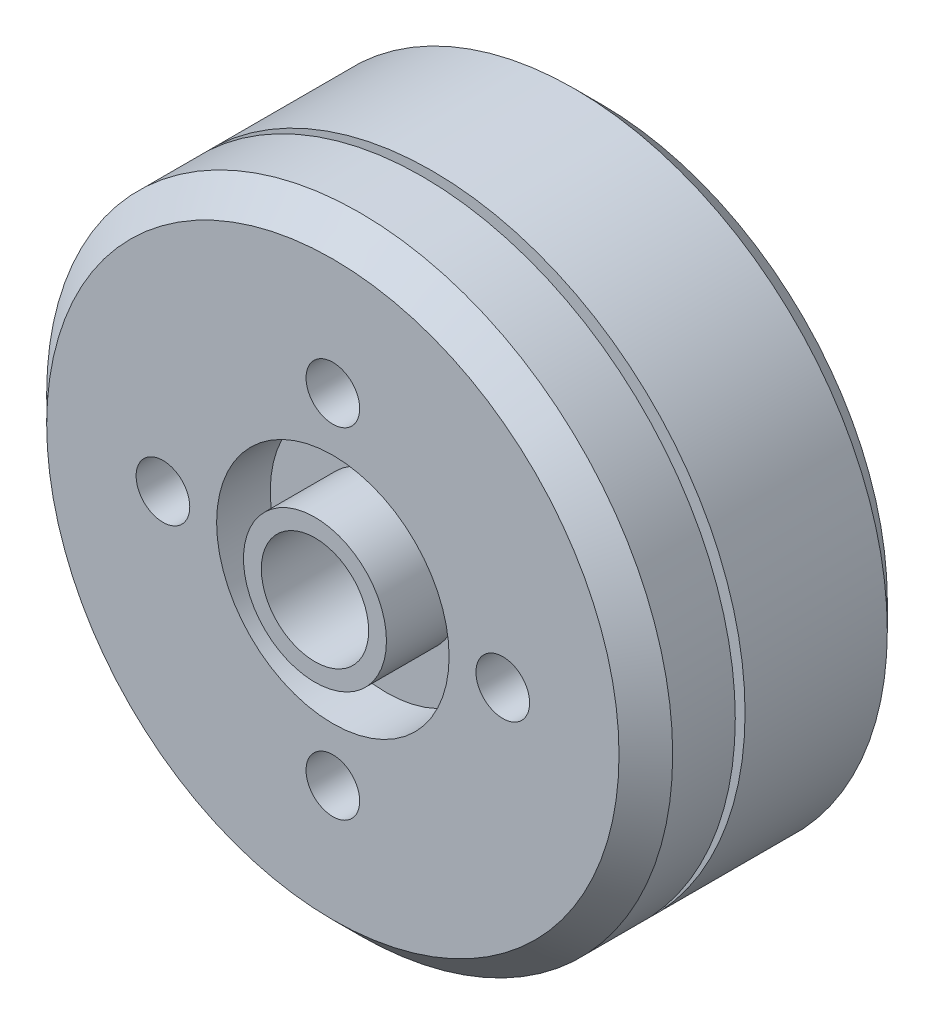
ISO-10303-21;
HEADER;
FILE_DESCRIPTION(('STEP AP214'),'2;1');
FILE_NAME('part.step','',(''),(''),'','','');
FILE_SCHEMA(('AUTOMOTIVE_DESIGN { 1 0 10303 214 1 1 1 1 }'));
ENDSEC;
DATA;
#1=APPLICATION_CONTEXT('core data for automotive mechanical design processes');
#2=APPLICATION_PROTOCOL_DEFINITION('international standard','automotive_design',2000,#1);
#3=PRODUCT_CONTEXT('',#1,'mechanical');
#4=PRODUCT('Part','Part','',(#3));
#5=PRODUCT_RELATED_PRODUCT_CATEGORY('part','',(#4));
#6=PRODUCT_DEFINITION_FORMATION('','',#4);
#7=PRODUCT_DEFINITION_CONTEXT('part definition',#1,'design');
#8=PRODUCT_DEFINITION('design','',#6,#7);
#9=PRODUCT_DEFINITION_SHAPE('','',#8);
#10=(LENGTH_UNIT() NAMED_UNIT(*) SI_UNIT(.MILLI.,.METRE.));
#11=(NAMED_UNIT(*) PLANE_ANGLE_UNIT() SI_UNIT($,.RADIAN.));
#12=(NAMED_UNIT(*) SI_UNIT($,.STERADIAN.) SOLID_ANGLE_UNIT());
#13=UNCERTAINTY_MEASURE_WITH_UNIT(LENGTH_MEASURE(1.E-05),#10,'distance_accuracy_value','');
#14=(GEOMETRIC_REPRESENTATION_CONTEXT(3) GLOBAL_UNCERTAINTY_ASSIGNED_CONTEXT((#13)) GLOBAL_UNIT_ASSIGNED_CONTEXT((#10,
#11,#12)) REPRESENTATION_CONTEXT('',''));
#15=CARTESIAN_POINT('',(0.,0.,0.));
#16=DIRECTION('',(0.,0.,1.));
#17=DIRECTION('',(1.,0.,0.));
#18=AXIS2_PLACEMENT_3D('',#15,#16,#17);
#19=CARTESIAN_POINT('',(0.,0.,15.));
#20=DIRECTION('',(0.,0.,-1.));
#21=DIRECTION('',(-1.,0.,0.));
#22=AXIS2_PLACEMENT_3D('',#19,#20,#21);
#23=CYLINDRICAL_SURFACE('',#22,17.5);
#24=CARTESIAN_POINT('',(0.,0.,1.5));
#25=DIRECTION('',(0.,0.,1.));
#26=DIRECTION('',(1.,0.,0.));
#27=AXIS2_PLACEMENT_3D('',#24,#25,#26);
#28=CIRCLE('',#27,17.5);
#29=CARTESIAN_POINT('',(17.5,0.,1.5));
#30=VERTEX_POINT('',#29);
#31=EDGE_CURVE('E45',#30,#30,#28,.T.);
#32=ORIENTED_EDGE('',*,*,#31,.T.);
#33=EDGE_LOOP('',(#32));
#34=FACE_BOUND('',#33,.T.);
#35=CARTESIAN_POINT('',(0.,0.,9.45314457112844));
#36=DIRECTION('',(0.,0.,-1.));
#37=DIRECTION('',(-1.,0.,0.));
#38=AXIS2_PLACEMENT_3D('',#35,#36,#37);
#39=CIRCLE('',#38,17.5);
#40=CARTESIAN_POINT('',(-17.5,0.,9.45314457112844));
#41=VERTEX_POINT('',#40);
#42=EDGE_CURVE('E62',#41,#41,#39,.T.);
#43=ORIENTED_EDGE('',*,*,#42,.T.);
#44=EDGE_LOOP('',(#43));
#45=FACE_BOUND('',#44,.T.);
#46=ADVANCED_FACE('F37',(#34,#45),#23,.T.);
#47=CARTESIAN_POINT('',(0.,0.,0.));
#48=DIRECTION('',(0.,0.,1.));
#49=DIRECTION('',(1.,0.,0.));
#50=AXIS2_PLACEMENT_3D('',#47,#48,#49);
#51=PLANE('',#50);
#52=CARTESIAN_POINT('',(0.,0.,0.));
#53=DIRECTION('',(0.,0.,1.));
#54=DIRECTION('',(1.,0.,0.));
#55=AXIS2_PLACEMENT_3D('',#52,#53,#54);
#56=CIRCLE('',#55,16.);
#57=CARTESIAN_POINT('',(16.,0.,0.));
#58=VERTEX_POINT('',#57);
#59=EDGE_CURVE('E10',#58,#58,#56,.F.);
#60=ORIENTED_EDGE('',*,*,#59,.T.);
#61=EDGE_LOOP('',(#60));
#62=FACE_BOUND('',#61,.T.);
#63=CARTESIAN_POINT('',(0.,0.,0.));
#64=DIRECTION('',(0.,0.,-1.));
#65=DIRECTION('',(-1.,0.,0.));
#66=AXIS2_PLACEMENT_3D('',#63,#64,#65);
#67=CIRCLE('',#66,3.);
#68=CARTESIAN_POINT('',(-3.,0.,0.));
#69=VERTEX_POINT('',#68);
#70=EDGE_CURVE('E109',#69,#69,#67,.T.);
#71=ORIENTED_EDGE('',*,*,#70,.F.);
#72=EDGE_LOOP('',(#71));
#73=FACE_BOUND('',#72,.T.);
#74=CARTESIAN_POINT('',(0.,-8.,0.));
#75=DIRECTION('',(0.,0.,-1.));
#76=DIRECTION('',(-1.,0.,0.));
#77=AXIS2_PLACEMENT_3D('',#74,#75,#76);
#78=CIRCLE('',#77,1.5);
#79=CARTESIAN_POINT('',(-1.5,-8.,0.));
#80=VERTEX_POINT('',#79);
#81=EDGE_CURVE('E95',#80,#80,#78,.T.);
#82=ORIENTED_EDGE('',*,*,#81,.F.);
#83=EDGE_LOOP('',(#82));
#84=FACE_BOUND('',#83,.T.);
#85=CARTESIAN_POINT('',(8.,0.,0.));
#86=DIRECTION('',(0.,0.,-1.));
#87=DIRECTION('',(-1.,0.,0.));
#88=AXIS2_PLACEMENT_3D('',#85,#86,#87);
#89=CIRCLE('',#88,1.5);
#90=CARTESIAN_POINT('',(6.5,0.,0.));
#91=VERTEX_POINT('',#90);
#92=EDGE_CURVE('E87',#91,#91,#89,.T.);
#93=ORIENTED_EDGE('',*,*,#92,.F.);
#94=EDGE_LOOP('',(#93));
#95=FACE_BOUND('',#94,.T.);
#96=CARTESIAN_POINT('',(0.,8.,0.));
#97=DIRECTION('',(0.,0.,-1.));
#98=DIRECTION('',(-1.,0.,0.));
#99=AXIS2_PLACEMENT_3D('',#96,#97,#98);
#100=CIRCLE('',#99,1.5);
#101=CARTESIAN_POINT('',(-1.50000000000005,8.,0.));
#102=VERTEX_POINT('',#101);
#103=EDGE_CURVE('E79',#102,#102,#100,.T.);
#104=ORIENTED_EDGE('',*,*,#103,.F.);
#105=EDGE_LOOP('',(#104));
#106=FACE_BOUND('',#105,.T.);
#107=CARTESIAN_POINT('',(-8.,0.,0.));
#108=DIRECTION('',(0.,0.,-1.));
#109=DIRECTION('',(-1.,0.,0.));
#110=AXIS2_PLACEMENT_3D('',#107,#108,#109);
#111=CIRCLE('',#110,1.5);
#112=CARTESIAN_POINT('',(-9.5,0.,0.));
#113=VERTEX_POINT('',#112);
#114=EDGE_CURVE('E66',#113,#113,#111,.T.);
#115=ORIENTED_EDGE('',*,*,#114,.F.);
#116=EDGE_LOOP('',(#115));
#117=FACE_BOUND('',#116,.T.);
#118=ADVANCED_FACE('F180',(#62,#73,#84,#95,#106,#117),#51,.F.);
#119=CARTESIAN_POINT('',(-8.,0.,4.99999999999999));
#120=DIRECTION('',(0.,0.,-1.));
#121=DIRECTION('',(-1.,0.,0.));
#122=AXIS2_PLACEMENT_3D('',#119,#120,#121);
#123=CYLINDRICAL_SURFACE('',#122,1.5);
#124=CARTESIAN_POINT('',(-8.,0.,4.99999999999999));
#125=DIRECTION('',(0.,0.,-1.));
#126=DIRECTION('',(-1.,0.,0.));
#127=AXIS2_PLACEMENT_3D('',#124,#125,#126);
#128=CIRCLE('',#127,1.5);
#129=CARTESIAN_POINT('',(-9.5,0.,4.99999999999999));
#130=VERTEX_POINT('',#129);
#131=EDGE_CURVE('E75',#130,#130,#128,.T.);
#132=ORIENTED_EDGE('',*,*,#131,.F.);
#133=EDGE_LOOP('',(#132));
#134=FACE_BOUND('',#133,.T.);
#135=ORIENTED_EDGE('',*,*,#114,.T.);
#136=EDGE_LOOP('',(#135));
#137=FACE_BOUND('',#136,.T.);
#138=ADVANCED_FACE('F186',(#134,#137),#123,.F.);
#139=CARTESIAN_POINT('',(-8.,0.,4.99999999999999));
#140=DIRECTION('',(0.,0.,-1.));
#141=DIRECTION('',(-1.,0.,0.));
#142=AXIS2_PLACEMENT_3D('',#139,#140,#141);
#143=PLANE('',#142);
#144=ORIENTED_EDGE('',*,*,#131,.T.);
#145=EDGE_LOOP('',(#144));
#146=FACE_BOUND('',#145,.T.);
#147=ADVANCED_FACE('F244',(#146),#143,.T.);
#148=CARTESIAN_POINT('',(0.,8.,4.99999999999999));
#149=DIRECTION('',(0.,0.,-1.));
#150=DIRECTION('',(-1.,0.,0.));
#151=AXIS2_PLACEMENT_3D('',#148,#149,#150);
#152=CYLINDRICAL_SURFACE('',#151,1.5);
#153=CARTESIAN_POINT('',(0.,8.,4.99999999999999));
#154=DIRECTION('',(0.,0.,-1.));
#155=DIRECTION('',(-1.,0.,0.));
#156=AXIS2_PLACEMENT_3D('',#153,#154,#155);
#157=CIRCLE('',#156,1.5);
#158=CARTESIAN_POINT('',(-1.50000000000005,8.,4.99999999999999));
#159=VERTEX_POINT('',#158);
#160=EDGE_CURVE('E83',#159,#159,#157,.T.);
#161=ORIENTED_EDGE('',*,*,#160,.F.);
#162=EDGE_LOOP('',(#161));
#163=FACE_BOUND('',#162,.T.);
#164=ORIENTED_EDGE('',*,*,#103,.T.);
#165=EDGE_LOOP('',(#164));
#166=FACE_BOUND('',#165,.T.);
#167=ADVANCED_FACE('F240',(#163,#166),#152,.F.);
#168=CARTESIAN_POINT('',(0.,8.,4.99999999999999));
#169=DIRECTION('',(0.,0.,-1.));
#170=DIRECTION('',(-1.,0.,0.));
#171=AXIS2_PLACEMENT_3D('',#168,#169,#170);
#172=PLANE('',#171);
#173=ORIENTED_EDGE('',*,*,#160,.T.);
#174=EDGE_LOOP('',(#173));
#175=FACE_BOUND('',#174,.T.);
#176=ADVANCED_FACE('F236',(#175),#172,.T.);
#177=CARTESIAN_POINT('',(8.,0.,4.99999999999999));
#178=DIRECTION('',(0.,0.,-1.));
#179=DIRECTION('',(-1.,0.,0.));
#180=AXIS2_PLACEMENT_3D('',#177,#178,#179);
#181=CYLINDRICAL_SURFACE('',#180,1.5);
#182=CARTESIAN_POINT('',(8.,0.,4.99999999999999));
#183=DIRECTION('',(0.,0.,-1.));
#184=DIRECTION('',(-1.,0.,0.));
#185=AXIS2_PLACEMENT_3D('',#182,#183,#184);
#186=CIRCLE('',#185,1.5);
#187=CARTESIAN_POINT('',(6.5,0.,4.99999999999999));
#188=VERTEX_POINT('',#187);
#189=EDGE_CURVE('E91',#188,#188,#186,.T.);
#190=ORIENTED_EDGE('',*,*,#189,.F.);
#191=EDGE_LOOP('',(#190));
#192=FACE_BOUND('',#191,.T.);
#193=ORIENTED_EDGE('',*,*,#92,.T.);
#194=EDGE_LOOP('',(#193));
#195=FACE_BOUND('',#194,.T.);
#196=ADVANCED_FACE('F232',(#192,#195),#181,.F.);
#197=CARTESIAN_POINT('',(8.,0.,4.99999999999999));
#198=DIRECTION('',(0.,0.,-1.));
#199=DIRECTION('',(-1.,0.,0.));
#200=AXIS2_PLACEMENT_3D('',#197,#198,#199);
#201=PLANE('',#200);
#202=ORIENTED_EDGE('',*,*,#189,.T.);
#203=EDGE_LOOP('',(#202));
#204=FACE_BOUND('',#203,.T.);
#205=ADVANCED_FACE('F228',(#204),#201,.T.);
#206=CARTESIAN_POINT('',(0.,-8.,4.99999999999999));
#207=DIRECTION('',(0.,0.,-1.));
#208=DIRECTION('',(-1.,0.,0.));
#209=AXIS2_PLACEMENT_3D('',#206,#207,#208);
#210=CYLINDRICAL_SURFACE('',#209,1.5);
#211=CARTESIAN_POINT('',(0.,-8.,4.99999999999999));
#212=DIRECTION('',(0.,0.,-1.));
#213=DIRECTION('',(-1.,0.,0.));
#214=AXIS2_PLACEMENT_3D('',#211,#212,#213);
#215=CIRCLE('',#214,1.5);
#216=CARTESIAN_POINT('',(-1.5,-8.,4.99999999999999));
#217=VERTEX_POINT('',#216);
#218=EDGE_CURVE('E61',#217,#217,#215,.T.);
#219=ORIENTED_EDGE('',*,*,#218,.F.);
#220=EDGE_LOOP('',(#219));
#221=FACE_BOUND('',#220,.T.);
#222=ORIENTED_EDGE('',*,*,#81,.T.);
#223=EDGE_LOOP('',(#222));
#224=FACE_BOUND('',#223,.T.);
#225=ADVANCED_FACE('F224',(#221,#224),#210,.F.);
#226=CARTESIAN_POINT('',(0.,-8.,4.99999999999999));
#227=DIRECTION('',(0.,0.,-1.));
#228=DIRECTION('',(-1.,0.,0.));
#229=AXIS2_PLACEMENT_3D('',#226,#227,#228);
#230=PLANE('',#229);
#231=ORIENTED_EDGE('',*,*,#218,.T.);
#232=EDGE_LOOP('',(#231));
#233=FACE_BOUND('',#232,.T.);
#234=ADVANCED_FACE('F217',(#233),#230,.T.);
#235=CARTESIAN_POINT('',(13.2844337972272,0.,9.45314457112844));
#236=DIRECTION('',(0.,0.,-1.));
#237=DIRECTION('',(-1.,0.,0.));
#238=AXIS2_PLACEMENT_3D('',#235,#236,#237);
#239=PLANE('',#238);
#240=CARTESIAN_POINT('',(0.,0.,9.45314457112844));
#241=DIRECTION('',(0.,0.,-1.));
#242=DIRECTION('',(-1.,0.,0.));
#243=AXIS2_PLACEMENT_3D('',#240,#241,#242);
#244=CIRCLE('',#243,13.2844337972272);
#245=CARTESIAN_POINT('',(-13.2844337972272,0.,9.45314457112844));
#246=VERTEX_POINT('',#245);
#247=EDGE_CURVE('E71',#246,#246,#244,.T.);
#248=ORIENTED_EDGE('',*,*,#247,.T.);
#249=EDGE_LOOP('',(#248));
#250=FACE_BOUND('',#249,.T.);
#251=ORIENTED_EDGE('',*,*,#42,.F.);
#252=EDGE_LOOP('',(#251));
#253=FACE_BOUND('',#252,.T.);
#254=ADVANCED_FACE('F208',(#250,#253),#239,.F.);
#255=CARTESIAN_POINT('',(17.969347124329,0.,10.));
#256=DIRECTION('',(0.,0.,1.));
#257=DIRECTION('',(1.,0.,0.));
#258=AXIS2_PLACEMENT_3D('',#255,#256,#257);
#259=PLANE('',#258);
#260=CARTESIAN_POINT('',(0.,0.,10.));
#261=DIRECTION('',(0.,0.,-1.));
#262=DIRECTION('',(-1.,0.,0.));
#263=AXIS2_PLACEMENT_3D('',#260,#261,#262);
#264=CIRCLE('',#263,13.2844337972272);
#265=CARTESIAN_POINT('',(-13.2844337972272,0.,10.));
#266=VERTEX_POINT('',#265);
#267=EDGE_CURVE('E105',#266,#266,#264,.T.);
#268=ORIENTED_EDGE('',*,*,#267,.F.);
#269=EDGE_LOOP('',(#268));
#270=FACE_BOUND('',#269,.T.);
#271=CARTESIAN_POINT('',(0.,0.,10.));
#272=DIRECTION('',(0.,0.,1.));
#273=DIRECTION('',(1.,0.,0.));
#274=AXIS2_PLACEMENT_3D('',#271,#272,#273);
#275=CIRCLE('',#274,17.5);
#276=CARTESIAN_POINT('',(17.5,0.,10.));
#277=VERTEX_POINT('',#276);
#278=EDGE_CURVE('E67',#277,#277,#275,.T.);
#279=ORIENTED_EDGE('',*,*,#278,.F.);
#280=EDGE_LOOP('',(#279));
#281=FACE_BOUND('',#280,.T.);
#282=ADVANCED_FACE('F206',(#270,#281),#259,.F.);
#283=CARTESIAN_POINT('',(0.,0.,0.));
#284=DIRECTION('',(0.,0.,-1.));
#285=DIRECTION('',(-1.,0.,0.));
#286=AXIS2_PLACEMENT_3D('',#283,#284,#285);
#287=CYLINDRICAL_SURFACE('',#286,13.2844337972272);
#288=ORIENTED_EDGE('',*,*,#247,.F.);
#289=EDGE_LOOP('',(#288));
#290=FACE_BOUND('',#289,.T.);
#291=ORIENTED_EDGE('',*,*,#267,.T.);
#292=EDGE_LOOP('',(#291));
#293=FACE_BOUND('',#292,.T.);
#294=ADVANCED_FACE('F199',(#290,#293),#287,.T.);
#295=CARTESIAN_POINT('',(0.,0.,15.));
#296=DIRECTION('',(0.,0.,1.));
#297=DIRECTION('',(1.,0.,0.));
#298=AXIS2_PLACEMENT_3D('',#295,#296,#297);
#299=PLANE('',#298);
#300=CARTESIAN_POINT('',(0.,0.,15.));
#301=DIRECTION('',(0.,0.,1.));
#302=DIRECTION('',(1.,0.,0.));
#303=AXIS2_PLACEMENT_3D('',#300,#301,#302);
#304=CIRCLE('',#303,6.5);
#305=CARTESIAN_POINT('',(6.5,0.,15.));
#306=VERTEX_POINT('',#305);
#307=EDGE_CURVE('E146',#306,#306,#304,.T.);
#308=ORIENTED_EDGE('',*,*,#307,.F.);
#309=EDGE_LOOP('',(#308));
#310=FACE_BOUND('',#309,.T.);
#311=CARTESIAN_POINT('',(0.,0.,15.));
#312=DIRECTION('',(0.,0.,1.));
#313=DIRECTION('',(1.,0.,0.));
#314=AXIS2_PLACEMENT_3D('',#311,#312,#313);
#315=CIRCLE('',#314,16.);
#316=CARTESIAN_POINT('',(16.,0.,15.));
#317=VERTEX_POINT('',#316);
#318=EDGE_CURVE('E55',#317,#317,#315,.T.);
#319=ORIENTED_EDGE('',*,*,#318,.T.);
#320=EDGE_LOOP('',(#319));
#321=FACE_BOUND('',#320,.T.);
#322=CARTESIAN_POINT('',(0.,-9.5,15.));
#323=DIRECTION('',(0.,0.,1.));
#324=DIRECTION('',(1.,0.,0.));
#325=AXIS2_PLACEMENT_3D('',#322,#323,#324);
#326=CIRCLE('',#325,1.5);
#327=CARTESIAN_POINT('',(1.5,-9.5,15.));
#328=VERTEX_POINT('',#327);
#329=EDGE_CURVE('E139',#328,#328,#326,.T.);
#330=ORIENTED_EDGE('',*,*,#329,.F.);
#331=EDGE_LOOP('',(#330));
#332=FACE_BOUND('',#331,.T.);
#333=CARTESIAN_POINT('',(-9.5,0.,15.));
#334=DIRECTION('',(0.,0.,1.));
#335=DIRECTION('',(1.,0.,0.));
#336=AXIS2_PLACEMENT_3D('',#333,#334,#335);
#337=CIRCLE('',#336,1.5);
#338=CARTESIAN_POINT('',(-8.,0.,15.));
#339=VERTEX_POINT('',#338);
#340=EDGE_CURVE('E131',#339,#339,#337,.T.);
#341=ORIENTED_EDGE('',*,*,#340,.F.);
#342=EDGE_LOOP('',(#341));
#343=FACE_BOUND('',#342,.T.);
#344=CARTESIAN_POINT('',(0.,9.5,15.));
#345=DIRECTION('',(0.,0.,1.));
#346=DIRECTION('',(1.,0.,0.));
#347=AXIS2_PLACEMENT_3D('',#344,#345,#346);
#348=CIRCLE('',#347,1.5);
#349=CARTESIAN_POINT('',(1.50000000000007,9.5,15.));
#350=VERTEX_POINT('',#349);
#351=EDGE_CURVE('E123',#350,#350,#348,.T.);
#352=ORIENTED_EDGE('',*,*,#351,.F.);
#353=EDGE_LOOP('',(#352));
#354=FACE_BOUND('',#353,.T.);
#355=CARTESIAN_POINT('',(9.5,-1.00078527173816E-13,15.));
#356=DIRECTION('',(0.,0.,1.));
#357=DIRECTION('',(1.,0.,0.));
#358=AXIS2_PLACEMENT_3D('',#355,#356,#357);
#359=CIRCLE('',#358,1.5);
#360=CARTESIAN_POINT('',(11.,-1.00078527173816E-13,15.));
#361=VERTEX_POINT('',#360);
#362=EDGE_CURVE('E114',#361,#361,#359,.T.);
#363=ORIENTED_EDGE('',*,*,#362,.F.);
#364=EDGE_LOOP('',(#363));
#365=FACE_BOUND('',#364,.T.);
#366=ADVANCED_FACE('F190',(#310,#321,#332,#343,#354,#365),#299,.T.);
#367=CARTESIAN_POINT('',(0.,0.,13.5));
#368=DIRECTION('',(0.,0.,1.));
#369=DIRECTION('',(1.,0.,0.));
#370=AXIS2_PLACEMENT_3D('',#367,#368,#369);
#371=CIRCLE('',#370,17.5);
#372=CARTESIAN_POINT('',(17.5,0.,13.5));
#373=VERTEX_POINT('',#372);
#374=EDGE_CURVE('E50',#373,#373,#371,.F.);
#375=ORIENTED_EDGE('',*,*,#374,.T.);
#376=EDGE_LOOP('',(#375));
#377=FACE_BOUND('',#376,.T.);
#378=ORIENTED_EDGE('',*,*,#278,.T.);
#379=EDGE_LOOP('',(#378));
#380=FACE_BOUND('',#379,.T.);
#381=ADVANCED_FACE('F182',(#377,#380),#23,.T.);
#382=CARTESIAN_POINT('',(0.,0.,20.));
#383=DIRECTION('',(0.,0.,-1.));
#384=DIRECTION('',(-1.,0.,0.));
#385=AXIS2_PLACEMENT_3D('',#382,#383,#384);
#386=CYLINDRICAL_SURFACE('',#385,3.);
#387=ORIENTED_EDGE('',*,*,#70,.T.);
#388=EDGE_LOOP('',(#387));
#389=FACE_BOUND('',#388,.T.);
#390=CARTESIAN_POINT('',(0.,0.,16.));
#391=DIRECTION('',(0.,0.,1.));
#392=DIRECTION('',(1.,0.,0.));
#393=AXIS2_PLACEMENT_3D('',#390,#391,#392);
#394=CIRCLE('',#393,3.);
#395=CARTESIAN_POINT('',(3.,0.,16.));
#396=VERTEX_POINT('',#395);
#397=EDGE_CURVE('E161',#396,#396,#394,.T.);
#398=ORIENTED_EDGE('',*,*,#397,.T.);
#399=EDGE_LOOP('',(#398));
#400=FACE_BOUND('',#399,.T.);
#401=ADVANCED_FACE('F166',(#389,#400),#386,.F.);
#402=CARTESIAN_POINT('',(9.5,-1.00078527173816E-13,9.00000000000001));
#403=DIRECTION('',(0.,0.,1.));
#404=DIRECTION('',(1.,0.,0.));
#405=AXIS2_PLACEMENT_3D('',#402,#403,#404);
#406=CYLINDRICAL_SURFACE('',#405,1.5);
#407=CARTESIAN_POINT('',(9.5,-1.00078527173816E-13,9.00000000000001));
#408=DIRECTION('',(0.,0.,1.));
#409=DIRECTION('',(1.,0.,0.));
#410=AXIS2_PLACEMENT_3D('',#407,#408,#409);
#411=CIRCLE('',#410,1.5);
#412=CARTESIAN_POINT('',(11.,-1.00078527173816E-13,9.00000000000001));
#413=VERTEX_POINT('',#412);
#414=EDGE_CURVE('E118',#413,#413,#411,.T.);
#415=ORIENTED_EDGE('',*,*,#414,.F.);
#416=EDGE_LOOP('',(#415));
#417=FACE_BOUND('',#416,.T.);
#418=ORIENTED_EDGE('',*,*,#362,.T.);
#419=EDGE_LOOP('',(#418));
#420=FACE_BOUND('',#419,.T.);
#421=ADVANCED_FACE('F196',(#417,#420),#406,.F.);
#422=CARTESIAN_POINT('',(9.5,-1.00078527173816E-13,9.00000000000001));
#423=DIRECTION('',(0.,0.,1.));
#424=DIRECTION('',(1.,0.,0.));
#425=AXIS2_PLACEMENT_3D('',#422,#423,#424);
#426=PLANE('',#425);
#427=ORIENTED_EDGE('',*,*,#414,.T.);
#428=EDGE_LOOP('',(#427));
#429=FACE_BOUND('',#428,.T.);
#430=ADVANCED_FACE('F313',(#429),#426,.T.);
#431=CARTESIAN_POINT('',(0.,9.5,9.00000000000001));
#432=DIRECTION('',(0.,0.,1.));
#433=DIRECTION('',(1.,0.,0.));
#434=AXIS2_PLACEMENT_3D('',#431,#432,#433);
#435=CYLINDRICAL_SURFACE('',#434,1.5);
#436=CARTESIAN_POINT('',(0.,9.5,9.00000000000001));
#437=DIRECTION('',(0.,0.,1.));
#438=DIRECTION('',(1.,0.,0.));
#439=AXIS2_PLACEMENT_3D('',#436,#437,#438);
#440=CIRCLE('',#439,1.5);
#441=CARTESIAN_POINT('',(1.50000000000007,9.5,9.00000000000001));
#442=VERTEX_POINT('',#441);
#443=EDGE_CURVE('E127',#442,#442,#440,.T.);
#444=ORIENTED_EDGE('',*,*,#443,.F.);
#445=EDGE_LOOP('',(#444));
#446=FACE_BOUND('',#445,.T.);
#447=ORIENTED_EDGE('',*,*,#351,.T.);
#448=EDGE_LOOP('',(#447));
#449=FACE_BOUND('',#448,.T.);
#450=ADVANCED_FACE('F323',(#446,#449),#435,.F.);
#451=CARTESIAN_POINT('',(0.,9.5,9.00000000000001));
#452=DIRECTION('',(0.,0.,1.));
#453=DIRECTION('',(1.,0.,0.));
#454=AXIS2_PLACEMENT_3D('',#451,#452,#453);
#455=PLANE('',#454);
#456=ORIENTED_EDGE('',*,*,#443,.T.);
#457=EDGE_LOOP('',(#456));
#458=FACE_BOUND('',#457,.T.);
#459=ADVANCED_FACE('F333',(#458),#455,.T.);
#460=CARTESIAN_POINT('',(-9.5,0.,9.00000000000001));
#461=DIRECTION('',(0.,0.,1.));
#462=DIRECTION('',(1.,0.,0.));
#463=AXIS2_PLACEMENT_3D('',#460,#461,#462);
#464=CYLINDRICAL_SURFACE('',#463,1.5);
#465=CARTESIAN_POINT('',(-9.5,0.,9.00000000000001));
#466=DIRECTION('',(0.,0.,1.));
#467=DIRECTION('',(1.,0.,0.));
#468=AXIS2_PLACEMENT_3D('',#465,#466,#467);
#469=CIRCLE('',#468,1.5);
#470=CARTESIAN_POINT('',(-8.,0.,9.00000000000001));
#471=VERTEX_POINT('',#470);
#472=EDGE_CURVE('E135',#471,#471,#469,.T.);
#473=ORIENTED_EDGE('',*,*,#472,.F.);
#474=EDGE_LOOP('',(#473));
#475=FACE_BOUND('',#474,.T.);
#476=ORIENTED_EDGE('',*,*,#340,.T.);
#477=EDGE_LOOP('',(#476));
#478=FACE_BOUND('',#477,.T.);
#479=ADVANCED_FACE('F343',(#475,#478),#464,.F.);
#480=CARTESIAN_POINT('',(-9.5,0.,9.00000000000001));
#481=DIRECTION('',(0.,0.,1.));
#482=DIRECTION('',(1.,0.,0.));
#483=AXIS2_PLACEMENT_3D('',#480,#481,#482);
#484=PLANE('',#483);
#485=ORIENTED_EDGE('',*,*,#472,.T.);
#486=EDGE_LOOP('',(#485));
#487=FACE_BOUND('',#486,.T.);
#488=ADVANCED_FACE('F353',(#487),#484,.T.);
#489=CARTESIAN_POINT('',(0.,-9.5,9.00000000000001));
#490=DIRECTION('',(0.,0.,1.));
#491=DIRECTION('',(1.,0.,0.));
#492=AXIS2_PLACEMENT_3D('',#489,#490,#491);
#493=CYLINDRICAL_SURFACE('',#492,1.5);
#494=CARTESIAN_POINT('',(0.,-9.5,9.00000000000001));
#495=DIRECTION('',(0.,0.,1.));
#496=DIRECTION('',(1.,0.,0.));
#497=AXIS2_PLACEMENT_3D('',#494,#495,#496);
#498=CIRCLE('',#497,1.5);
#499=CARTESIAN_POINT('',(1.5,-9.5,9.00000000000001));
#500=VERTEX_POINT('',#499);
#501=EDGE_CURVE('E113',#500,#500,#498,.T.);
#502=ORIENTED_EDGE('',*,*,#501,.F.);
#503=EDGE_LOOP('',(#502));
#504=FACE_BOUND('',#503,.T.);
#505=ORIENTED_EDGE('',*,*,#329,.T.);
#506=EDGE_LOOP('',(#505));
#507=FACE_BOUND('',#506,.T.);
#508=ADVANCED_FACE('F363',(#504,#507),#493,.F.);
#509=CARTESIAN_POINT('',(0.,-9.5,9.00000000000001));
#510=DIRECTION('',(0.,0.,1.));
#511=DIRECTION('',(1.,0.,0.));
#512=AXIS2_PLACEMENT_3D('',#509,#510,#511);
#513=PLANE('',#512);
#514=ORIENTED_EDGE('',*,*,#501,.T.);
#515=EDGE_LOOP('',(#514));
#516=FACE_BOUND('',#515,.T.);
#517=ADVANCED_FACE('F373',(#516),#513,.T.);
#518=CARTESIAN_POINT('',(0.,0.,15.));
#519=DIRECTION('',(0.,0.,-1.));
#520=DIRECTION('',(-1.,0.,0.));
#521=AXIS2_PLACEMENT_3D('',#518,#519,#520);
#522=CONICAL_SURFACE('',#521,16.,0.785398163397446);
#523=ORIENTED_EDGE('',*,*,#374,.F.);
#524=EDGE_LOOP('',(#523));
#525=FACE_BOUND('',#524,.T.);
#526=ORIENTED_EDGE('',*,*,#318,.F.);
#527=EDGE_LOOP('',(#526));
#528=FACE_BOUND('',#527,.T.);
#529=ADVANCED_FACE('F382',(#525,#528),#522,.T.);
#530=CARTESIAN_POINT('',(0.,0.,1.5));
#531=DIRECTION('',(0.,0.,1.));
#532=DIRECTION('',(1.,0.,0.));
#533=AXIS2_PLACEMENT_3D('',#530,#531,#532);
#534=CONICAL_SURFACE('',#533,17.5,0.785398163397449);
#535=ORIENTED_EDGE('',*,*,#59,.F.);
#536=EDGE_LOOP('',(#535));
#537=FACE_BOUND('',#536,.T.);
#538=ORIENTED_EDGE('',*,*,#31,.F.);
#539=EDGE_LOOP('',(#538));
#540=FACE_BOUND('',#539,.T.);
#541=ADVANCED_FACE('F39',(#537,#540),#534,.T.);
#542=CARTESIAN_POINT('',(0.,0.,12.));
#543=DIRECTION('',(0.,0.,1.));
#544=DIRECTION('',(1.,0.,0.));
#545=AXIS2_PLACEMENT_3D('',#542,#543,#544);
#546=CYLINDRICAL_SURFACE('',#545,6.5);
#547=CARTESIAN_POINT('',(0.,0.,12.));
#548=DIRECTION('',(0.,0.,1.));
#549=DIRECTION('',(1.,0.,0.));
#550=AXIS2_PLACEMENT_3D('',#547,#548,#549);
#551=CIRCLE('',#550,6.5);
#552=CARTESIAN_POINT('',(6.5,0.,12.));
#553=VERTEX_POINT('',#552);
#554=EDGE_CURVE('E119',#553,#553,#551,.T.);
#555=ORIENTED_EDGE('',*,*,#554,.F.);
#556=EDGE_LOOP('',(#555));
#557=FACE_BOUND('',#556,.T.);
#558=ORIENTED_EDGE('',*,*,#307,.T.);
#559=EDGE_LOOP('',(#558));
#560=FACE_BOUND('',#559,.T.);
#561=ADVANCED_FACE('F413',(#557,#560),#546,.F.);
#562=CARTESIAN_POINT('',(0.,0.,12.));
#563=DIRECTION('',(0.,0.,1.));
#564=DIRECTION('',(1.,0.,0.));
#565=AXIS2_PLACEMENT_3D('',#562,#563,#564);
#566=PLANE('',#565);
#567=CARTESIAN_POINT('',(0.,0.,12.));
#568=DIRECTION('',(0.,0.,1.));
#569=DIRECTION('',(1.,0.,0.));
#570=AXIS2_PLACEMENT_3D('',#567,#568,#569);
#571=CIRCLE('',#570,3.99661585051879);
#572=CARTESIAN_POINT('',(3.99661585051879,0.,12.));
#573=VERTEX_POINT('',#572);
#574=EDGE_CURVE('E150',#573,#573,#571,.T.);
#575=ORIENTED_EDGE('',*,*,#574,.F.);
#576=EDGE_LOOP('',(#575));
#577=FACE_BOUND('',#576,.T.);
#578=ORIENTED_EDGE('',*,*,#554,.T.);
#579=EDGE_LOOP('',(#578));
#580=FACE_BOUND('',#579,.T.);
#581=ADVANCED_FACE('F176',(#577,#580),#566,.T.);
#582=CARTESIAN_POINT('',(0.,0.,12.));
#583=DIRECTION('',(0.,0.,1.));
#584=DIRECTION('',(1.,0.,0.));
#585=AXIS2_PLACEMENT_3D('',#582,#583,#584);
#586=CYLINDRICAL_SURFACE('',#585,3.99661585051879);
#587=ORIENTED_EDGE('',*,*,#574,.T.);
#588=EDGE_LOOP('',(#587));
#589=FACE_BOUND('',#588,.T.);
#590=CARTESIAN_POINT('',(0.,0.,16.));
#591=DIRECTION('',(0.,0.,1.));
#592=DIRECTION('',(1.,0.,0.));
#593=AXIS2_PLACEMENT_3D('',#590,#591,#592);
#594=CIRCLE('',#593,3.99661585051879);
#595=CARTESIAN_POINT('',(3.99661585051879,0.,16.));
#596=VERTEX_POINT('',#595);
#597=EDGE_CURVE('E157',#596,#596,#594,.T.);
#598=ORIENTED_EDGE('',*,*,#597,.F.);
#599=EDGE_LOOP('',(#598));
#600=FACE_BOUND('',#599,.T.);
#601=ADVANCED_FACE('F170',(#589,#600),#586,.T.);
#602=CARTESIAN_POINT('',(0.,0.,16.));
#603=DIRECTION('',(0.,0.,1.));
#604=DIRECTION('',(1.,0.,0.));
#605=AXIS2_PLACEMENT_3D('',#602,#603,#604);
#606=PLANE('',#605);
#607=ORIENTED_EDGE('',*,*,#597,.T.);
#608=EDGE_LOOP('',(#607));
#609=FACE_BOUND('',#608,.T.);
#610=ORIENTED_EDGE('',*,*,#397,.F.);
#611=EDGE_LOOP('',(#610));
#612=FACE_BOUND('',#611,.T.);
#613=ADVANCED_FACE('F168',(#609,#612),#606,.T.);
#614=CLOSED_SHELL('',(#46,#118,#138,#147,#167,#176,#196,#205,#225,#234,#254,#282,#294,#366,#381,
#401,#421,#430,#450,#459,#479,#488,#508,#517,#529,#541,#561,#581,#601,#613));
#615=MANIFOLD_SOLID_BREP('B2',#614);
#616=ADVANCED_BREP_SHAPE_REPRESENTATION('',(#18,#615),#14);
#617=SHAPE_DEFINITION_REPRESENTATION(#9,#616);
ENDSEC;
END-ISO-10303-21;
